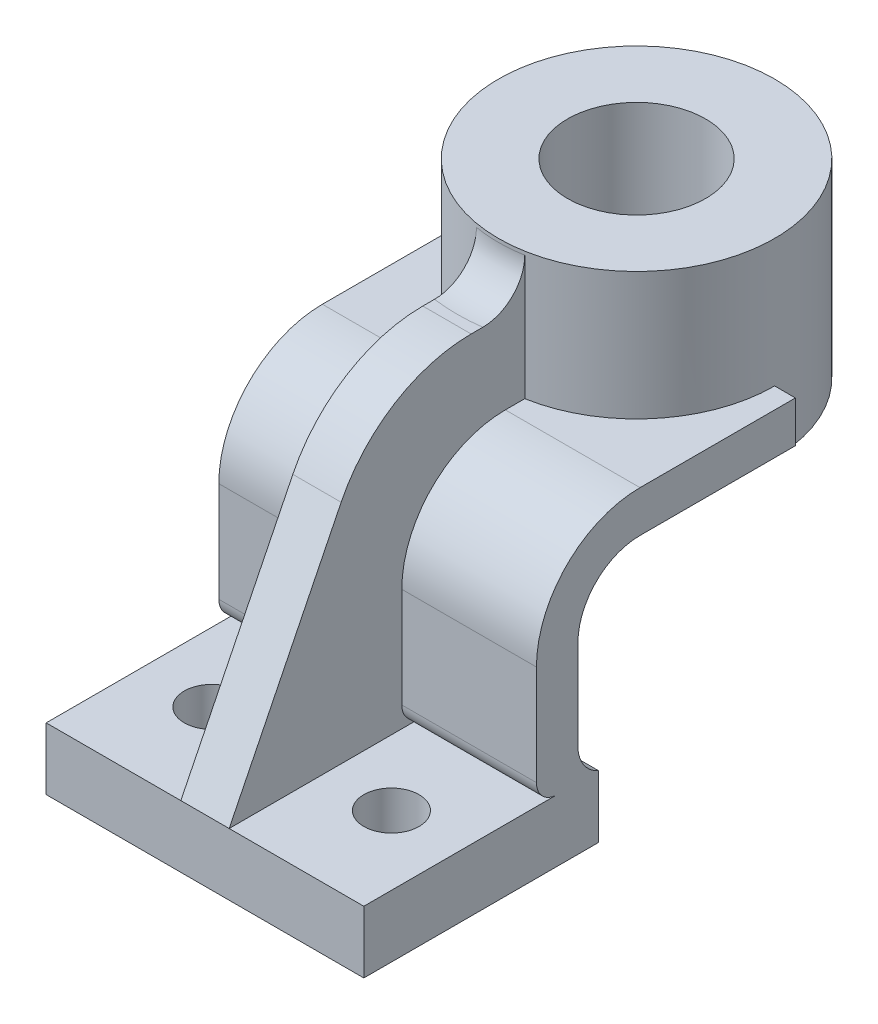
ISO-10303-21;
HEADER;
FILE_DESCRIPTION(('STEP AP214'),'2;1');
FILE_NAME('part.step','',(''),(''),'','','');
FILE_SCHEMA(('AUTOMOTIVE_DESIGN { 1 0 10303 214 1 1 1 1 }'));
ENDSEC;
DATA;
#1=APPLICATION_CONTEXT('core data for automotive mechanical design processes');
#2=APPLICATION_PROTOCOL_DEFINITION('international standard','automotive_design',2000,#1);
#3=PRODUCT_CONTEXT('',#1,'mechanical');
#4=PRODUCT('Part','Part','',(#3));
#5=PRODUCT_RELATED_PRODUCT_CATEGORY('part','',(#4));
#6=PRODUCT_DEFINITION_FORMATION('','',#4);
#7=PRODUCT_DEFINITION_CONTEXT('part definition',#1,'design');
#8=PRODUCT_DEFINITION('design','',#6,#7);
#9=PRODUCT_DEFINITION_SHAPE('','',#8);
#10=(LENGTH_UNIT() NAMED_UNIT(*) SI_UNIT(.MILLI.,.METRE.));
#11=(NAMED_UNIT(*) PLANE_ANGLE_UNIT() SI_UNIT($,.RADIAN.));
#12=(NAMED_UNIT(*) SI_UNIT($,.STERADIAN.) SOLID_ANGLE_UNIT());
#13=UNCERTAINTY_MEASURE_WITH_UNIT(LENGTH_MEASURE(1.E-05),#10,'distance_accuracy_value','');
#14=(GEOMETRIC_REPRESENTATION_CONTEXT(3) GLOBAL_UNCERTAINTY_ASSIGNED_CONTEXT((#13)) GLOBAL_UNIT_ASSIGNED_CONTEXT((#10,
#11,#12)) REPRESENTATION_CONTEXT('',''));
#15=CARTESIAN_POINT('',(0.,0.,0.));
#16=DIRECTION('',(0.,0.,1.));
#17=DIRECTION('',(1.,0.,0.));
#18=AXIS2_PLACEMENT_3D('',#15,#16,#17);
#19=CARTESIAN_POINT('',(0.,18.,0.));
#20=DIRECTION('',(0.,1.,0.));
#21=DIRECTION('',(0.,0.,1.));
#22=AXIS2_PLACEMENT_3D('',#19,#20,#21);
#23=PLANE('',#22);
#24=CARTESIAN_POINT('',(-26.,18.,6.00000000000001));
#25=DIRECTION('',(0.,1.,0.));
#26=DIRECTION('',(0.,0.,1.));
#27=AXIS2_PLACEMENT_3D('',#24,#25,#26);
#28=CIRCLE('',#27,8.);
#29=CARTESIAN_POINT('',(-26.,18.,14.));
#30=VERTEX_POINT('',#29);
#31=EDGE_CURVE('E283',#30,#30,#28,.T.);
#32=ORIENTED_EDGE('',*,*,#31,.F.);
#33=EDGE_LOOP('',(#32));
#34=FACE_BOUND('',#33,.T.);
#35=DIRECTION('',(1.,0.,0.));
#36=VECTOR('',#35,1.);
#37=CARTESIAN_POINT('',(46.,18.,34.));
#38=LINE('',#37,#36);
#39=CARTESIAN_POINT('',(-46.,18.,34.));
#40=VERTEX_POINT('',#39);
#41=CARTESIAN_POINT('',(-7.,18.,34.));
#42=VERTEX_POINT('',#41);
#43=EDGE_CURVE('E245',#40,#42,#38,.T.);
#44=ORIENTED_EDGE('',*,*,#43,.T.);
#45=DIRECTION('',(0.,0.,-1.));
#46=VECTOR('',#45,1.);
#47=CARTESIAN_POINT('',(-7.,18.,0.));
#48=LINE('',#47,#46);
#49=CARTESIAN_POINT('',(-7.,18.,-22.0000000000001));
#50=VERTEX_POINT('',#49);
#51=EDGE_CURVE('E230',#42,#50,#48,.T.);
#52=ORIENTED_EDGE('',*,*,#51,.T.);
#53=DIRECTION('',(1.,0.,0.));
#54=VECTOR('',#53,1.);
#55=CARTESIAN_POINT('',(-46.,18.,-22.0000000000001));
#56=LINE('',#55,#54);
#57=CARTESIAN_POINT('',(-46.,18.,-22.0000000000001));
#58=VERTEX_POINT('',#57);
#59=EDGE_CURVE('E279',#58,#50,#56,.T.);
#60=ORIENTED_EDGE('',*,*,#59,.F.);
#61=DIRECTION('',(0.,0.,1.));
#62=VECTOR('',#61,1.);
#63=CARTESIAN_POINT('',(-46.,18.,34.));
#64=LINE('',#63,#62);
#65=EDGE_CURVE('E252',#58,#40,#64,.T.);
#66=ORIENTED_EDGE('',*,*,#65,.T.);
#67=EDGE_LOOP('',(#44,#52,#60,#66));
#68=FACE_BOUND('',#67,.T.);
#69=ADVANCED_FACE('F41',(#34,#68),#23,.T.);
#70=CARTESIAN_POINT('',(-46.,24.,-22.));
#71=DIRECTION('',(1.,0.,0.));
#72=DIRECTION('',(0.,0.,-1.));
#73=AXIS2_PLACEMENT_3D('',#70,#71,#72);
#74=CYLINDRICAL_SURFACE('',#73,6.);
#75=ORIENTED_EDGE('',*,*,#59,.T.);
#76=CARTESIAN_POINT('',(-7.,24.,-22.));
#77=DIRECTION('',(1.,0.,0.));
#78=DIRECTION('',(0.,0.,-1.));
#79=AXIS2_PLACEMENT_3D('',#76,#77,#78);
#80=CIRCLE('',#79,6.);
#81=CARTESIAN_POINT('',(-7.,24.,-16.));
#82=VERTEX_POINT('',#81);
#83=EDGE_CURVE('E233',#50,#82,#80,.F.);
#84=ORIENTED_EDGE('',*,*,#83,.T.);
#85=DIRECTION('',(1.,0.,0.));
#86=VECTOR('',#85,1.);
#87=CARTESIAN_POINT('',(-46.,24.,-16.));
#88=LINE('',#87,#86);
#89=CARTESIAN_POINT('',(-46.,24.,-16.));
#90=VERTEX_POINT('',#89);
#91=EDGE_CURVE('E320',#90,#82,#88,.T.);
#92=ORIENTED_EDGE('',*,*,#91,.F.);
#93=CARTESIAN_POINT('',(-46.,24.,-22.));
#94=DIRECTION('',(1.,0.,0.));
#95=DIRECTION('',(0.,0.,-1.));
#96=AXIS2_PLACEMENT_3D('',#93,#94,#95);
#97=CIRCLE('',#96,6.);
#98=EDGE_CURVE('E296',#90,#58,#97,.T.);
#99=ORIENTED_EDGE('',*,*,#98,.T.);
#100=EDGE_LOOP('',(#75,#84,#92,#99));
#101=FACE_BOUND('',#100,.T.);
#102=ADVANCED_FACE('F519',(#101),#74,.T.);
#103=CARTESIAN_POINT('',(-46.,24.,-16.));
#104=DIRECTION('',(0.,0.,1.));
#105=DIRECTION('',(1.,0.,0.));
#106=AXIS2_PLACEMENT_3D('',#103,#104,#105);
#107=PLANE('',#106);
#108=ORIENTED_EDGE('',*,*,#91,.T.);
#109=DIRECTION('',(0.,1.,0.));
#110=VECTOR('',#109,1.);
#111=CARTESIAN_POINT('',(-7.,24.,-16.));
#112=LINE('',#111,#110);
#113=CARTESIAN_POINT('',(-7.,52.9999999999999,-16.));
#114=VERTEX_POINT('',#113);
#115=EDGE_CURVE('E441',#82,#114,#112,.T.);
#116=ORIENTED_EDGE('',*,*,#115,.T.);
#117=DIRECTION('',(1.,0.,0.));
#118=VECTOR('',#117,1.);
#119=CARTESIAN_POINT('',(-46.,52.9999999999999,-16.));
#120=LINE('',#119,#118);
#121=CARTESIAN_POINT('',(-46.,52.9999999999999,-16.));
#122=VERTEX_POINT('',#121);
#123=EDGE_CURVE('E315',#122,#114,#120,.T.);
#124=ORIENTED_EDGE('',*,*,#123,.F.);
#125=DIRECTION('',(0.,-1.,0.));
#126=VECTOR('',#125,1.);
#127=CARTESIAN_POINT('',(-46.,24.,-16.));
#128=LINE('',#127,#126);
#129=EDGE_CURVE('E363',#122,#90,#128,.T.);
#130=ORIENTED_EDGE('',*,*,#129,.T.);
#131=EDGE_LOOP('',(#108,#116,#124,#130));
#132=FACE_BOUND('',#131,.T.);
#133=ADVANCED_FACE('F524',(#132),#107,.T.);
#134=CARTESIAN_POINT('',(-46.,53.,-46.));
#135=DIRECTION('',(1.,0.,0.));
#136=DIRECTION('',(0.,0.,-1.));
#137=AXIS2_PLACEMENT_3D('',#134,#135,#136);
#138=CYLINDRICAL_SURFACE('',#137,30.);
#139=ORIENTED_EDGE('',*,*,#123,.T.);
#140=CARTESIAN_POINT('',(-7.,53.,-46.));
#141=DIRECTION('',(1.,0.,0.));
#142=DIRECTION('',(0.,0.,-1.));
#143=AXIS2_PLACEMENT_3D('',#140,#141,#142);
#144=CIRCLE('',#143,30.);
#145=CARTESIAN_POINT('',(-7.,83.,-46.0000000000002));
#146=VERTEX_POINT('',#145);
#147=EDGE_CURVE('E437',#114,#146,#144,.F.);
#148=ORIENTED_EDGE('',*,*,#147,.T.);
#149=DIRECTION('',(1.,0.,0.));
#150=VECTOR('',#149,1.);
#151=CARTESIAN_POINT('',(-46.,83.,-46.0000000000002));
#152=LINE('',#151,#150);
#153=CARTESIAN_POINT('',(-46.,83.,-46.0000000000002));
#154=VERTEX_POINT('',#153);
#155=EDGE_CURVE('E310',#154,#146,#152,.T.);
#156=ORIENTED_EDGE('',*,*,#155,.F.);
#157=CARTESIAN_POINT('',(-46.,53.,-46.));
#158=DIRECTION('',(1.,0.,0.));
#159=DIRECTION('',(0.,0.,1.));
#160=AXIS2_PLACEMENT_3D('',#157,#158,#159);
#161=CIRCLE('',#160,30.);
#162=EDGE_CURVE('E367',#154,#122,#161,.T.);
#163=ORIENTED_EDGE('',*,*,#162,.T.);
#164=EDGE_LOOP('',(#139,#148,#156,#163));
#165=FACE_BOUND('',#164,.T.);
#166=ADVANCED_FACE('F529',(#165),#138,.T.);
#167=CARTESIAN_POINT('',(-46.,83.,-46.0000000000002));
#168=DIRECTION('',(0.,1.,0.));
#169=DIRECTION('',(0.,0.,1.));
#170=AXIS2_PLACEMENT_3D('',#167,#168,#169);
#171=PLANE('',#170);
#172=ORIENTED_EDGE('',*,*,#155,.T.);
#173=DIRECTION('',(0.,0.,-1.));
#174=VECTOR('',#173,1.);
#175=CARTESIAN_POINT('',(-7.,83.,-46.0000000000002));
#176=LINE('',#175,#174);
#177=CARTESIAN_POINT('',(-7.,83.,-51.6172626649696));
#178=VERTEX_POINT('',#177);
#179=EDGE_CURVE('E433',#146,#178,#176,.T.);
#180=ORIENTED_EDGE('',*,*,#179,.T.);
#181=CARTESIAN_POINT('',(0.,83.,-91.));
#182=DIRECTION('',(0.,1.,0.));
#183=DIRECTION('',(0.,0.,1.));
#184=AXIS2_PLACEMENT_3D('',#181,#182,#183);
#185=CIRCLE('',#184,40.);
#186=CARTESIAN_POINT('',(-40.,83.,-91.));
#187=VERTEX_POINT('',#186);
#188=EDGE_CURVE('E360',#187,#178,#185,.T.);
#189=ORIENTED_EDGE('',*,*,#188,.F.);
#190=DIRECTION('',(1.,0.,0.));
#191=VECTOR('',#190,1.);
#192=CARTESIAN_POINT('',(-46.,83.,-91.));
#193=LINE('',#192,#191);
#194=CARTESIAN_POINT('',(-46.,83.,-91.));
#195=VERTEX_POINT('',#194);
#196=EDGE_CURVE('E305',#195,#187,#193,.T.);
#197=ORIENTED_EDGE('',*,*,#196,.F.);
#198=DIRECTION('',(0.,0.,1.));
#199=VECTOR('',#198,1.);
#200=CARTESIAN_POINT('',(-46.,83.,-46.0000000000002));
#201=LINE('',#200,#199);
#202=EDGE_CURVE('E371',#195,#154,#201,.T.);
#203=ORIENTED_EDGE('',*,*,#202,.T.);
#204=EDGE_LOOP('',(#172,#180,#189,#197,#203));
#205=FACE_BOUND('',#204,.T.);
#206=ADVANCED_FACE('F534',(#205),#171,.T.);
#207=CARTESIAN_POINT('',(-46.,83.,-91.));
#208=DIRECTION('',(0.,0.,-1.));
#209=DIRECTION('',(-1.,0.,0.));
#210=AXIS2_PLACEMENT_3D('',#207,#208,#209);
#211=PLANE('',#210);
#212=DIRECTION('',(0.,1.,0.));
#213=VECTOR('',#212,1.);
#214=CARTESIAN_POINT('',(-40.,65.,-91.));
#215=LINE('',#214,#213);
#216=CARTESIAN_POINT('',(-40.,71.,-91.));
#217=VERTEX_POINT('',#216);
#218=EDGE_CURVE('E392',#217,#187,#215,.T.);
#219=ORIENTED_EDGE('',*,*,#218,.F.);
#220=DIRECTION('',(1.,0.,0.));
#221=VECTOR('',#220,1.);
#222=CARTESIAN_POINT('',(-46.,71.,-91.));
#223=LINE('',#222,#221);
#224=CARTESIAN_POINT('',(-46.,71.,-91.));
#225=VERTEX_POINT('',#224);
#226=EDGE_CURVE('E300',#225,#217,#223,.T.);
#227=ORIENTED_EDGE('',*,*,#226,.F.);
#228=DIRECTION('',(0.,1.,0.));
#229=VECTOR('',#228,1.);
#230=CARTESIAN_POINT('',(-46.,83.,-91.));
#231=LINE('',#230,#229);
#232=EDGE_CURVE('E375',#225,#195,#231,.T.);
#233=ORIENTED_EDGE('',*,*,#232,.T.);
#234=ORIENTED_EDGE('',*,*,#196,.T.);
#235=EDGE_LOOP('',(#219,#227,#233,#234));
#236=FACE_BOUND('',#235,.T.);
#237=ADVANCED_FACE('F539',(#236),#211,.T.);
#238=DIRECTION('',(0.,0.,-1.));
#239=VECTOR('',#238,1.);
#240=CARTESIAN_POINT('',(7.,18.,0.));
#241=LINE('',#240,#239);
#242=CARTESIAN_POINT('',(7.,18.,34.));
#243=VERTEX_POINT('',#242);
#244=CARTESIAN_POINT('',(7.,18.,-22.0000000000001));
#245=VERTEX_POINT('',#244);
#246=EDGE_CURVE('E428',#243,#245,#241,.T.);
#247=ORIENTED_EDGE('',*,*,#246,.F.);
#248=CARTESIAN_POINT('',(46.,18.,34.));
#249=VERTEX_POINT('',#248);
#250=EDGE_CURVE('E248',#243,#249,#38,.T.);
#251=ORIENTED_EDGE('',*,*,#250,.T.);
#252=DIRECTION('',(0.,0.,-1.));
#253=VECTOR('',#252,1.);
#254=CARTESIAN_POINT('',(46.,18.,34.));
#255=LINE('',#254,#253);
#256=CARTESIAN_POINT('',(46.,18.,-22.0000000000001));
#257=VERTEX_POINT('',#256);
#258=EDGE_CURVE('E254',#249,#257,#255,.T.);
#259=ORIENTED_EDGE('',*,*,#258,.T.);
#260=EDGE_CURVE('E324',#245,#257,#56,.T.);
#261=ORIENTED_EDGE('',*,*,#260,.F.);
#262=EDGE_LOOP('',(#247,#251,#259,#261));
#263=FACE_BOUND('',#262,.T.);
#264=CARTESIAN_POINT('',(26.,18.,6.00000000000001));
#265=DIRECTION('',(0.,1.,0.));
#266=DIRECTION('',(0.,0.,1.));
#267=AXIS2_PLACEMENT_3D('',#264,#265,#266);
#268=CIRCLE('',#267,7.99999999999999);
#269=CARTESIAN_POINT('',(26.,18.,14.));
#270=VERTEX_POINT('',#269);
#271=EDGE_CURVE('E274',#270,#270,#268,.T.);
#272=ORIENTED_EDGE('',*,*,#271,.F.);
#273=EDGE_LOOP('',(#272));
#274=FACE_BOUND('',#273,.T.);
#275=ADVANCED_FACE('F559',(#263,#274),#23,.T.);
#276=CARTESIAN_POINT('',(-46.,18.,34.));
#277=DIRECTION('',(1.,0.,0.));
#278=DIRECTION('',(0.,0.,-1.));
#279=AXIS2_PLACEMENT_3D('',#276,#277,#278);
#280=PLANE('',#279);
#281=DIRECTION('',(0.,0.,1.));
#282=VECTOR('',#281,1.);
#283=CARTESIAN_POINT('',(-46.,0.,34.));
#284=LINE('',#283,#282);
#285=CARTESIAN_POINT('',(-46.,0.,-34.));
#286=VERTEX_POINT('',#285);
#287=CARTESIAN_POINT('',(-46.,0.,34.));
#288=VERTEX_POINT('',#287);
#289=EDGE_CURVE('E291',#286,#288,#284,.T.);
#290=ORIENTED_EDGE('',*,*,#289,.T.);
#291=DIRECTION('',(0.,-1.,0.));
#292=VECTOR('',#291,1.);
#293=CARTESIAN_POINT('',(-46.,18.,34.));
#294=LINE('',#293,#292);
#295=EDGE_CURVE('E601',#40,#288,#294,.T.);
#296=ORIENTED_EDGE('',*,*,#295,.F.);
#297=ORIENTED_EDGE('',*,*,#65,.F.);
#298=ORIENTED_EDGE('',*,*,#98,.F.);
#299=ORIENTED_EDGE('',*,*,#129,.F.);
#300=ORIENTED_EDGE('',*,*,#162,.F.);
#301=ORIENTED_EDGE('',*,*,#202,.F.);
#302=ORIENTED_EDGE('',*,*,#232,.F.);
#303=DIRECTION('',(0.,0.,-1.));
#304=VECTOR('',#303,1.);
#305=CARTESIAN_POINT('',(-46.,71.,-46.0000000000001));
#306=LINE('',#305,#304);
#307=CARTESIAN_POINT('',(-46.,71.,-46.0000000000001));
#308=VERTEX_POINT('',#307);
#309=EDGE_CURVE('E379',#308,#225,#306,.T.);
#310=ORIENTED_EDGE('',*,*,#309,.F.);
#311=CARTESIAN_POINT('',(-46.,53.,-46.));
#312=DIRECTION('',(-1.,0.,0.));
#313=DIRECTION('',(0.,0.,1.));
#314=AXIS2_PLACEMENT_3D('',#311,#312,#313);
#315=CIRCLE('',#314,18.);
#316=CARTESIAN_POINT('',(-46.,52.9999999999999,-28.));
#317=VERTEX_POINT('',#316);
#318=EDGE_CURVE('E383',#317,#308,#315,.T.);
#319=ORIENTED_EDGE('',*,*,#318,.F.);
#320=DIRECTION('',(0.,1.,0.));
#321=VECTOR('',#320,1.);
#322=CARTESIAN_POINT('',(-46.,18.,-28.));
#323=LINE('',#322,#321);
#324=CARTESIAN_POINT('',(-46.,27.1651513899117,-28.));
#325=VERTEX_POINT('',#324);
#326=EDGE_CURVE('E331',#325,#317,#323,.T.);
#327=ORIENTED_EDGE('',*,*,#326,.F.);
#328=CARTESIAN_POINT('',(-46.,27.1651513899117,-38.));
#329=DIRECTION('',(1.,0.,0.));
#330=DIRECTION('',(0.,0.,-1.));
#331=AXIS2_PLACEMENT_3D('',#328,#329,#330);
#332=CIRCLE('',#331,10.);
#333=CARTESIAN_POINT('',(-46.,18.,-34.));
#334=VERTEX_POINT('',#333);
#335=EDGE_CURVE('E620',#325,#334,#332,.T.);
#336=ORIENTED_EDGE('',*,*,#335,.T.);
#337=DIRECTION('',(0.,-1.,0.));
#338=VECTOR('',#337,1.);
#339=CARTESIAN_POINT('',(-46.,18.,-34.));
#340=LINE('',#339,#338);
#341=EDGE_CURVE('E690',#334,#286,#340,.T.);
#342=ORIENTED_EDGE('',*,*,#341,.T.);
#343=EDGE_LOOP('',(#290,#296,#297,#298,#299,#300,#301,#302,#310,#319,#327,#336,#342));
#344=FACE_BOUND('',#343,.T.);
#345=ADVANCED_FACE('F562',(#344),#280,.F.);
#346=CARTESIAN_POINT('',(46.,18.,34.));
#347=DIRECTION('',(0.,0.,-1.));
#348=DIRECTION('',(-1.,0.,0.));
#349=AXIS2_PLACEMENT_3D('',#346,#347,#348);
#350=PLANE('',#349);
#351=ORIENTED_EDGE('',*,*,#250,.F.);
#352=EDGE_CURVE('E219',#42,#243,#38,.T.);
#353=ORIENTED_EDGE('',*,*,#352,.F.);
#354=ORIENTED_EDGE('',*,*,#43,.F.);
#355=ORIENTED_EDGE('',*,*,#295,.T.);
#356=DIRECTION('',(1.,0.,0.));
#357=VECTOR('',#356,1.);
#358=CARTESIAN_POINT('',(46.,0.,34.));
#359=LINE('',#358,#357);
#360=CARTESIAN_POINT('',(46.,0.,34.));
#361=VERTEX_POINT('',#360);
#362=EDGE_CURVE('E720',#288,#361,#359,.T.);
#363=ORIENTED_EDGE('',*,*,#362,.T.);
#364=DIRECTION('',(0.,-1.,0.));
#365=VECTOR('',#364,1.);
#366=CARTESIAN_POINT('',(46.,18.,34.));
#367=LINE('',#366,#365);
#368=EDGE_CURVE('E605',#249,#361,#367,.T.);
#369=ORIENTED_EDGE('',*,*,#368,.F.);
#370=EDGE_LOOP('',(#351,#353,#354,#355,#363,#369));
#371=FACE_BOUND('',#370,.T.);
#372=ADVANCED_FACE('F243',(#371),#350,.F.);
#373=CARTESIAN_POINT('',(46.,18.,34.));
#374=DIRECTION('',(-1.,0.,0.));
#375=DIRECTION('',(0.,0.,1.));
#376=AXIS2_PLACEMENT_3D('',#373,#374,#375);
#377=PLANE('',#376);
#378=DIRECTION('',(0.,0.,-1.));
#379=VECTOR('',#378,1.);
#380=CARTESIAN_POINT('',(46.,0.,34.));
#381=LINE('',#380,#379);
#382=CARTESIAN_POINT('',(46.,0.,-34.));
#383=VERTEX_POINT('',#382);
#384=EDGE_CURVE('E271',#361,#383,#381,.T.);
#385=ORIENTED_EDGE('',*,*,#384,.T.);
#386=DIRECTION('',(0.,-1.,0.));
#387=VECTOR('',#386,1.);
#388=CARTESIAN_POINT('',(46.,18.,-34.));
#389=LINE('',#388,#387);
#390=CARTESIAN_POINT('',(46.,18.,-34.));
#391=VERTEX_POINT('',#390);
#392=EDGE_CURVE('E614',#391,#383,#389,.T.);
#393=ORIENTED_EDGE('',*,*,#392,.F.);
#394=CARTESIAN_POINT('',(46.,27.1651513899117,-38.));
#395=DIRECTION('',(-1.,0.,0.));
#396=DIRECTION('',(0.,0.,1.));
#397=AXIS2_PLACEMENT_3D('',#394,#395,#396);
#398=CIRCLE('',#397,10.);
#399=CARTESIAN_POINT('',(46.,27.1651513899117,-28.));
#400=VERTEX_POINT('',#399);
#401=EDGE_CURVE('E610',#391,#400,#398,.T.);
#402=ORIENTED_EDGE('',*,*,#401,.T.);
#403=DIRECTION('',(0.,1.,0.));
#404=VECTOR('',#403,1.);
#405=CARTESIAN_POINT('',(46.,18.,-28.));
#406=LINE('',#405,#404);
#407=CARTESIAN_POINT('',(46.,52.9999999999999,-28.));
#408=VERTEX_POINT('',#407);
#409=EDGE_CURVE('E356',#400,#408,#406,.T.);
#410=ORIENTED_EDGE('',*,*,#409,.T.);
#411=CARTESIAN_POINT('',(46.,53.,-46.));
#412=DIRECTION('',(-1.,0.,0.));
#413=DIRECTION('',(0.,0.,1.));
#414=AXIS2_PLACEMENT_3D('',#411,#412,#413);
#415=CIRCLE('',#414,18.);
#416=CARTESIAN_POINT('',(46.,71.,-46.0000000000001));
#417=VERTEX_POINT('',#416);
#418=EDGE_CURVE('E352',#408,#417,#415,.T.);
#419=ORIENTED_EDGE('',*,*,#418,.T.);
#420=DIRECTION('',(0.,0.,-1.));
#421=VECTOR('',#420,1.);
#422=CARTESIAN_POINT('',(46.,71.,-46.0000000000001));
#423=LINE('',#422,#421);
#424=CARTESIAN_POINT('',(46.,71.,-91.));
#425=VERTEX_POINT('',#424);
#426=EDGE_CURVE('E348',#417,#425,#423,.T.);
#427=ORIENTED_EDGE('',*,*,#426,.T.);
#428=DIRECTION('',(0.,1.,0.));
#429=VECTOR('',#428,1.);
#430=CARTESIAN_POINT('',(46.,83.,-91.));
#431=LINE('',#430,#429);
#432=CARTESIAN_POINT('',(46.,83.,-91.));
#433=VERTEX_POINT('',#432);
#434=EDGE_CURVE('E344',#425,#433,#431,.T.);
#435=ORIENTED_EDGE('',*,*,#434,.T.);
#436=DIRECTION('',(0.,0.,1.));
#437=VECTOR('',#436,1.);
#438=CARTESIAN_POINT('',(46.,83.,-46.0000000000002));
#439=LINE('',#438,#437);
#440=CARTESIAN_POINT('',(46.,83.,-46.0000000000002));
#441=VERTEX_POINT('',#440);
#442=EDGE_CURVE('E340',#433,#441,#439,.T.);
#443=ORIENTED_EDGE('',*,*,#442,.T.);
#444=CARTESIAN_POINT('',(46.,53.,-46.));
#445=DIRECTION('',(1.,0.,0.));
#446=DIRECTION('',(0.,0.,1.));
#447=AXIS2_PLACEMENT_3D('',#444,#445,#446);
#448=CIRCLE('',#447,30.);
#449=CARTESIAN_POINT('',(46.,52.9999999999999,-16.));
#450=VERTEX_POINT('',#449);
#451=EDGE_CURVE('E336',#441,#450,#448,.T.);
#452=ORIENTED_EDGE('',*,*,#451,.T.);
#453=DIRECTION('',(0.,-1.,0.));
#454=VECTOR('',#453,1.);
#455=CARTESIAN_POINT('',(46.,24.,-16.));
#456=LINE('',#455,#454);
#457=CARTESIAN_POINT('',(46.,24.,-16.));
#458=VERTEX_POINT('',#457);
#459=EDGE_CURVE('E332',#450,#458,#456,.T.);
#460=ORIENTED_EDGE('',*,*,#459,.T.);
#461=CARTESIAN_POINT('',(46.,24.,-22.));
#462=DIRECTION('',(1.,0.,0.));
#463=DIRECTION('',(0.,0.,-1.));
#464=AXIS2_PLACEMENT_3D('',#461,#462,#463);
#465=CIRCLE('',#464,6.);
#466=EDGE_CURVE('E327',#458,#257,#465,.T.);
#467=ORIENTED_EDGE('',*,*,#466,.T.);
#468=ORIENTED_EDGE('',*,*,#258,.F.);
#469=ORIENTED_EDGE('',*,*,#368,.T.);
#470=EDGE_LOOP('',(#385,#393,#402,#410,#419,#427,#435,#443,#452,#460,#467,#468,#469));
#471=FACE_BOUND('',#470,.T.);
#472=ADVANCED_FACE('F569',(#471),#377,.F.);
#473=CARTESIAN_POINT('',(46.,18.,-34.));
#474=DIRECTION('',(0.,0.,1.));
#475=DIRECTION('',(1.,0.,0.));
#476=AXIS2_PLACEMENT_3D('',#473,#474,#475);
#477=PLANE('',#476);
#478=DIRECTION('',(-1.,0.,0.));
#479=VECTOR('',#478,1.);
#480=CARTESIAN_POINT('',(46.,0.,-34.));
#481=LINE('',#480,#479);
#482=EDGE_CURVE('E267',#383,#286,#481,.T.);
#483=ORIENTED_EDGE('',*,*,#482,.T.);
#484=ORIENTED_EDGE('',*,*,#341,.F.);
#485=DIRECTION('',(-1.,0.,0.));
#486=VECTOR('',#485,1.);
#487=CARTESIAN_POINT('',(46.,18.,-34.));
#488=LINE('',#487,#486);
#489=EDGE_CURVE('E260',#391,#334,#488,.T.);
#490=ORIENTED_EDGE('',*,*,#489,.F.);
#491=ORIENTED_EDGE('',*,*,#392,.T.);
#492=EDGE_LOOP('',(#483,#484,#490,#491));
#493=FACE_BOUND('',#492,.T.);
#494=ADVANCED_FACE('F565',(#493),#477,.F.);
#495=CARTESIAN_POINT('',(0.,0.,0.));
#496=DIRECTION('',(0.,1.,0.));
#497=DIRECTION('',(0.,0.,1.));
#498=AXIS2_PLACEMENT_3D('',#495,#496,#497);
#499=PLANE('',#498);
#500=CARTESIAN_POINT('',(26.,0.,6.00000000000001));
#501=DIRECTION('',(0.,1.,0.));
#502=DIRECTION('',(0.,0.,1.));
#503=AXIS2_PLACEMENT_3D('',#500,#501,#502);
#504=CIRCLE('',#503,7.99999999999999);
#505=CARTESIAN_POINT('',(26.,0.,14.));
#506=VERTEX_POINT('',#505);
#507=EDGE_CURVE('E278',#506,#506,#504,.T.);
#508=ORIENTED_EDGE('',*,*,#507,.T.);
#509=EDGE_LOOP('',(#508));
#510=FACE_BOUND('',#509,.T.);
#511=ORIENTED_EDGE('',*,*,#384,.F.);
#512=ORIENTED_EDGE('',*,*,#362,.F.);
#513=ORIENTED_EDGE('',*,*,#289,.F.);
#514=ORIENTED_EDGE('',*,*,#482,.F.);
#515=EDGE_LOOP('',(#511,#512,#513,#514));
#516=FACE_BOUND('',#515,.T.);
#517=CARTESIAN_POINT('',(-26.,0.,6.00000000000001));
#518=DIRECTION('',(0.,1.,0.));
#519=DIRECTION('',(0.,0.,1.));
#520=AXIS2_PLACEMENT_3D('',#517,#518,#519);
#521=CIRCLE('',#520,8.);
#522=CARTESIAN_POINT('',(-26.,0.,14.));
#523=VERTEX_POINT('',#522);
#524=EDGE_CURVE('E287',#523,#523,#521,.T.);
#525=ORIENTED_EDGE('',*,*,#524,.T.);
#526=EDGE_LOOP('',(#525));
#527=FACE_BOUND('',#526,.T.);
#528=ADVANCED_FACE('F557',(#510,#516,#527),#499,.F.);
#529=CARTESIAN_POINT('',(26.,0.,6.00000000000001));
#530=DIRECTION('',(0.,1.,0.));
#531=DIRECTION('',(0.,0.,1.));
#532=AXIS2_PLACEMENT_3D('',#529,#530,#531);
#533=CYLINDRICAL_SURFACE('',#532,7.99999999999999);
#534=ORIENTED_EDGE('',*,*,#507,.F.);
#535=EDGE_LOOP('',(#534));
#536=FACE_BOUND('',#535,.T.);
#537=ORIENTED_EDGE('',*,*,#271,.T.);
#538=EDGE_LOOP('',(#537));
#539=FACE_BOUND('',#538,.T.);
#540=ADVANCED_FACE('F553',(#536,#539),#533,.F.);
#541=CARTESIAN_POINT('',(-26.,0.,6.00000000000001));
#542=DIRECTION('',(0.,1.,0.));
#543=DIRECTION('',(0.,0.,1.));
#544=AXIS2_PLACEMENT_3D('',#541,#542,#543);
#545=CYLINDRICAL_SURFACE('',#544,8.);
#546=ORIENTED_EDGE('',*,*,#524,.F.);
#547=EDGE_LOOP('',(#546));
#548=FACE_BOUND('',#547,.T.);
#549=ORIENTED_EDGE('',*,*,#31,.T.);
#550=EDGE_LOOP('',(#549));
#551=FACE_BOUND('',#550,.T.);
#552=ADVANCED_FACE('F517',(#548,#551),#545,.F.);
#553=CARTESIAN_POINT('',(7.,24.,-22.));
#554=DIRECTION('',(1.,0.,0.));
#555=DIRECTION('',(0.,0.,-1.));
#556=AXIS2_PLACEMENT_3D('',#553,#554,#555);
#557=CIRCLE('',#556,6.);
#558=CARTESIAN_POINT('',(7.,24.,-16.));
#559=VERTEX_POINT('',#558);
#560=EDGE_CURVE('E425',#245,#559,#557,.F.);
#561=ORIENTED_EDGE('',*,*,#560,.F.);
#562=ORIENTED_EDGE('',*,*,#260,.T.);
#563=ORIENTED_EDGE('',*,*,#466,.F.);
#564=EDGE_CURVE('E319',#559,#458,#88,.T.);
#565=ORIENTED_EDGE('',*,*,#564,.F.);
#566=EDGE_LOOP('',(#561,#562,#563,#565));
#567=FACE_BOUND('',#566,.T.);
#568=ADVANCED_FACE('F513',(#567),#74,.T.);
#569=DIRECTION('',(0.,1.,0.));
#570=VECTOR('',#569,1.);
#571=CARTESIAN_POINT('',(7.,24.,-16.));
#572=LINE('',#571,#570);
#573=CARTESIAN_POINT('',(7.,52.9999999999999,-16.));
#574=VERTEX_POINT('',#573);
#575=EDGE_CURVE('E422',#559,#574,#572,.T.);
#576=ORIENTED_EDGE('',*,*,#575,.F.);
#577=ORIENTED_EDGE('',*,*,#564,.T.);
#578=ORIENTED_EDGE('',*,*,#459,.F.);
#579=EDGE_CURVE('E314',#574,#450,#120,.T.);
#580=ORIENTED_EDGE('',*,*,#579,.F.);
#581=EDGE_LOOP('',(#576,#577,#578,#580));
#582=FACE_BOUND('',#581,.T.);
#583=ADVANCED_FACE('F516',(#582),#107,.T.);
#584=CARTESIAN_POINT('',(7.,53.,-46.));
#585=DIRECTION('',(1.,0.,0.));
#586=DIRECTION('',(0.,0.,-1.));
#587=AXIS2_PLACEMENT_3D('',#584,#585,#586);
#588=CIRCLE('',#587,30.);
#589=CARTESIAN_POINT('',(7.,83.,-46.0000000000002));
#590=VERTEX_POINT('',#589);
#591=EDGE_CURVE('E419',#574,#590,#588,.F.);
#592=ORIENTED_EDGE('',*,*,#591,.F.);
#593=ORIENTED_EDGE('',*,*,#579,.T.);
#594=ORIENTED_EDGE('',*,*,#451,.F.);
#595=EDGE_CURVE('E309',#590,#441,#152,.T.);
#596=ORIENTED_EDGE('',*,*,#595,.F.);
#597=EDGE_LOOP('',(#592,#593,#594,#596));
#598=FACE_BOUND('',#597,.T.);
#599=ADVANCED_FACE('F522',(#598),#138,.T.);
#600=DIRECTION('',(0.,0.,-1.));
#601=VECTOR('',#600,1.);
#602=CARTESIAN_POINT('',(7.,83.,-46.0000000000002));
#603=LINE('',#602,#601);
#604=CARTESIAN_POINT('',(7.,83.,-51.6172626649696));
#605=VERTEX_POINT('',#604);
#606=EDGE_CURVE('E416',#590,#605,#603,.T.);
#607=ORIENTED_EDGE('',*,*,#606,.F.);
#608=ORIENTED_EDGE('',*,*,#595,.T.);
#609=ORIENTED_EDGE('',*,*,#442,.F.);
#610=CARTESIAN_POINT('',(40.,83.,-91.));
#611=VERTEX_POINT('',#610);
#612=EDGE_CURVE('E304',#611,#433,#193,.T.);
#613=ORIENTED_EDGE('',*,*,#612,.F.);
#614=EDGE_CURVE('E391',#605,#611,#185,.T.);
#615=ORIENTED_EDGE('',*,*,#614,.F.);
#616=EDGE_LOOP('',(#607,#608,#609,#613,#615));
#617=FACE_BOUND('',#616,.T.);
#618=ADVANCED_FACE('F527',(#617),#171,.T.);
#619=DIRECTION('',(0.,1.,0.));
#620=VECTOR('',#619,1.);
#621=CARTESIAN_POINT('',(40.,65.,-91.));
#622=LINE('',#621,#620);
#623=CARTESIAN_POINT('',(40.,71.,-91.));
#624=VERTEX_POINT('',#623);
#625=EDGE_CURVE('E396',#611,#624,#622,.F.);
#626=ORIENTED_EDGE('',*,*,#625,.F.);
#627=ORIENTED_EDGE('',*,*,#612,.T.);
#628=ORIENTED_EDGE('',*,*,#434,.F.);
#629=EDGE_CURVE('E299',#624,#425,#223,.T.);
#630=ORIENTED_EDGE('',*,*,#629,.F.);
#631=EDGE_LOOP('',(#626,#627,#628,#630));
#632=FACE_BOUND('',#631,.T.);
#633=ADVANCED_FACE('F532',(#632),#211,.T.);
#634=CARTESIAN_POINT('',(-46.,71.,-46.0000000000001));
#635=DIRECTION('',(0.,-1.,0.));
#636=DIRECTION('',(0.,0.,-1.));
#637=AXIS2_PLACEMENT_3D('',#634,#635,#636);
#638=PLANE('',#637);
#639=ORIENTED_EDGE('',*,*,#426,.F.);
#640=DIRECTION('',(1.,0.,0.));
#641=VECTOR('',#640,1.);
#642=CARTESIAN_POINT('',(-46.,71.,-46.0000000000001));
#643=LINE('',#642,#641);
#644=EDGE_CURVE('E295',#308,#417,#643,.T.);
#645=ORIENTED_EDGE('',*,*,#644,.F.);
#646=ORIENTED_EDGE('',*,*,#309,.T.);
#647=ORIENTED_EDGE('',*,*,#226,.T.);
#648=CARTESIAN_POINT('',(0.,71.,-91.));
#649=DIRECTION('',(0.,-1.,0.));
#650=DIRECTION('',(0.,0.,-1.));
#651=AXIS2_PLACEMENT_3D('',#648,#649,#650);
#652=CIRCLE('',#651,40.);
#653=EDGE_CURVE('E624',#624,#217,#652,.T.);
#654=ORIENTED_EDGE('',*,*,#653,.F.);
#655=ORIENTED_EDGE('',*,*,#629,.T.);
#656=EDGE_LOOP('',(#639,#645,#646,#647,#654,#655));
#657=FACE_BOUND('',#656,.T.);
#658=ADVANCED_FACE('F537',(#657),#638,.T.);
#659=CARTESIAN_POINT('',(-46.,53.,-46.));
#660=DIRECTION('',(1.,0.,0.));
#661=DIRECTION('',(0.,0.,-1.));
#662=AXIS2_PLACEMENT_3D('',#659,#660,#661);
#663=CYLINDRICAL_SURFACE('',#662,18.);
#664=ORIENTED_EDGE('',*,*,#418,.F.);
#665=DIRECTION('',(1.,0.,0.));
#666=VECTOR('',#665,1.);
#667=CARTESIAN_POINT('',(-46.,52.9999999999999,-28.));
#668=LINE('',#667,#666);
#669=EDGE_CURVE('E292',#317,#408,#668,.T.);
#670=ORIENTED_EDGE('',*,*,#669,.F.);
#671=ORIENTED_EDGE('',*,*,#318,.T.);
#672=ORIENTED_EDGE('',*,*,#644,.T.);
#673=EDGE_LOOP('',(#664,#670,#671,#672));
#674=FACE_BOUND('',#673,.T.);
#675=ADVANCED_FACE('F542',(#674),#663,.F.);
#676=CARTESIAN_POINT('',(-46.,18.,-28.));
#677=DIRECTION('',(0.,0.,-1.));
#678=DIRECTION('',(-1.,0.,0.));
#679=AXIS2_PLACEMENT_3D('',#676,#677,#678);
#680=PLANE('',#679);
#681=DIRECTION('',(-1.,0.,0.));
#682=VECTOR('',#681,1.);
#683=CARTESIAN_POINT('',(-46.,27.1651513899117,-28.));
#684=LINE('',#683,#682);
#685=EDGE_CURVE('E604',#400,#325,#684,.T.);
#686=ORIENTED_EDGE('',*,*,#685,.T.);
#687=ORIENTED_EDGE('',*,*,#326,.T.);
#688=ORIENTED_EDGE('',*,*,#669,.T.);
#689=ORIENTED_EDGE('',*,*,#409,.F.);
#690=EDGE_LOOP('',(#686,#687,#688,#689));
#691=FACE_BOUND('',#690,.T.);
#692=ADVANCED_FACE('F546',(#691),#680,.T.);
#693=CARTESIAN_POINT('',(0.,27.1651513899117,-38.));
#694=DIRECTION('',(1.,0.,0.));
#695=DIRECTION('',(0.,0.,-1.));
#696=AXIS2_PLACEMENT_3D('',#693,#694,#695);
#697=CYLINDRICAL_SURFACE('',#696,10.);
#698=ORIENTED_EDGE('',*,*,#489,.T.);
#699=ORIENTED_EDGE('',*,*,#335,.F.);
#700=ORIENTED_EDGE('',*,*,#685,.F.);
#701=ORIENTED_EDGE('',*,*,#401,.F.);
#702=EDGE_LOOP('',(#698,#699,#700,#701));
#703=FACE_BOUND('',#702,.T.);
#704=ADVANCED_FACE('F511',(#703),#697,.F.);
#705=CARTESIAN_POINT('',(0.,65.,-91.));
#706=DIRECTION('',(0.,1.,0.));
#707=DIRECTION('',(0.,0.,1.));
#708=AXIS2_PLACEMENT_3D('',#705,#706,#707);
#709=CYLINDRICAL_SURFACE('',#708,40.);
#710=CARTESIAN_POINT('',(0.,65.,-91.));
#711=DIRECTION('',(0.,1.,0.));
#712=DIRECTION('',(0.,0.,1.));
#713=AXIS2_PLACEMENT_3D('',#710,#711,#712);
#714=CIRCLE('',#713,40.);
#715=CARTESIAN_POINT('',(0.,65.,-51.));
#716=VERTEX_POINT('',#715);
#717=EDGE_CURVE('E400',#716,#716,#714,.T.);
#718=ORIENTED_EDGE('',*,*,#717,.T.);
#719=EDGE_LOOP('',(#718));
#720=FACE_BOUND('',#719,.T.);
#721=DIRECTION('',(0.,1.,0.));
#722=VECTOR('',#721,1.);
#723=CARTESIAN_POINT('',(-7.,65.,-51.6172626649696));
#724=LINE('',#723,#722);
#725=CARTESIAN_POINT('',(-7.,119.,-51.6172626649696));
#726=VERTEX_POINT('',#725);
#727=EDGE_CURVE('E63',#178,#726,#724,.T.);
#728=ORIENTED_EDGE('',*,*,#727,.T.);
#729=CARTESIAN_POINT('',(0.,119.,-91.));
#730=DIRECTION('',(0.,1.,0.));
#731=DIRECTION('',(0.,0.,1.));
#732=AXIS2_PLACEMENT_3D('',#729,#730,#731);
#733=CIRCLE('',#732,40.);
#734=CARTESIAN_POINT('',(7.,119.,-51.6172626649696));
#735=VERTEX_POINT('',#734);
#736=EDGE_CURVE('E478',#726,#735,#733,.T.);
#737=ORIENTED_EDGE('',*,*,#736,.T.);
#738=DIRECTION('',(0.,1.,0.));
#739=VECTOR('',#738,1.);
#740=CARTESIAN_POINT('',(7.,65.,-51.6172626649696));
#741=LINE('',#740,#739);
#742=EDGE_CURVE('E70',#605,#735,#741,.T.);
#743=ORIENTED_EDGE('',*,*,#742,.F.);
#744=ORIENTED_EDGE('',*,*,#614,.T.);
#745=ORIENTED_EDGE('',*,*,#625,.T.);
#746=ORIENTED_EDGE('',*,*,#653,.T.);
#747=ORIENTED_EDGE('',*,*,#218,.T.);
#748=ORIENTED_EDGE('',*,*,#188,.T.);
#749=EDGE_LOOP('',(#728,#737,#743,#744,#745,#746,#747,#748));
#750=FACE_BOUND('',#749,.T.);
#751=CARTESIAN_POINT('',(0.,120.,-91.));
#752=DIRECTION('',(0.,1.,0.));
#753=DIRECTION('',(0.,0.,1.));
#754=AXIS2_PLACEMENT_3D('',#751,#752,#753);
#755=CIRCLE('',#754,40.);
#756=CARTESIAN_POINT('',(0.,120.,-51.));
#757=VERTEX_POINT('',#756);
#758=EDGE_CURVE('E404',#757,#757,#755,.T.);
#759=ORIENTED_EDGE('',*,*,#758,.F.);
#760=EDGE_LOOP('',(#759));
#761=FACE_BOUND('',#760,.T.);
#762=ADVANCED_FACE('F507',(#720,#750,#761),#709,.T.);
#763=CARTESIAN_POINT('',(0.,65.,-91.));
#764=DIRECTION('',(0.,1.,0.));
#765=DIRECTION('',(0.,0.,1.));
#766=AXIS2_PLACEMENT_3D('',#763,#764,#765);
#767=PLANE('',#766);
#768=CARTESIAN_POINT('',(0.,65.,-91.));
#769=DIRECTION('',(0.,1.,0.));
#770=DIRECTION('',(0.,0.,1.));
#771=AXIS2_PLACEMENT_3D('',#768,#769,#770);
#772=CIRCLE('',#771,20.);
#773=CARTESIAN_POINT('',(0.,65.,-71.));
#774=VERTEX_POINT('',#773);
#775=EDGE_CURVE('E408',#774,#774,#772,.T.);
#776=ORIENTED_EDGE('',*,*,#775,.T.);
#777=EDGE_LOOP('',(#776));
#778=FACE_BOUND('',#777,.T.);
#779=ORIENTED_EDGE('',*,*,#717,.F.);
#780=EDGE_LOOP('',(#779));
#781=FACE_BOUND('',#780,.T.);
#782=ADVANCED_FACE('F503',(#778,#781),#767,.F.);
#783=CARTESIAN_POINT('',(0.,120.,-91.));
#784=DIRECTION('',(0.,1.,0.));
#785=DIRECTION('',(0.,0.,1.));
#786=AXIS2_PLACEMENT_3D('',#783,#784,#785);
#787=PLANE('',#786);
#788=CARTESIAN_POINT('',(0.,120.,-91.));
#789=DIRECTION('',(0.,1.,0.));
#790=DIRECTION('',(0.,0.,1.));
#791=AXIS2_PLACEMENT_3D('',#788,#789,#790);
#792=CIRCLE('',#791,20.);
#793=CARTESIAN_POINT('',(0.,120.,-71.));
#794=VERTEX_POINT('',#793);
#795=EDGE_CURVE('E412',#794,#794,#792,.T.);
#796=ORIENTED_EDGE('',*,*,#795,.F.);
#797=EDGE_LOOP('',(#796));
#798=FACE_BOUND('',#797,.T.);
#799=ORIENTED_EDGE('',*,*,#758,.T.);
#800=EDGE_LOOP('',(#799));
#801=FACE_BOUND('',#800,.T.);
#802=ADVANCED_FACE('F499',(#798,#801),#787,.T.);
#803=CARTESIAN_POINT('',(0.,0.,-91.));
#804=DIRECTION('',(0.,1.,0.));
#805=DIRECTION('',(0.,0.,1.));
#806=AXIS2_PLACEMENT_3D('',#803,#804,#805);
#807=CYLINDRICAL_SURFACE('',#806,20.);
#808=ORIENTED_EDGE('',*,*,#775,.F.);
#809=EDGE_LOOP('',(#808));
#810=FACE_BOUND('',#809,.T.);
#811=ORIENTED_EDGE('',*,*,#795,.T.);
#812=EDGE_LOOP('',(#811));
#813=FACE_BOUND('',#812,.T.);
#814=ADVANCED_FACE('F493',(#810,#813),#807,.F.);
#815=CARTESIAN_POINT('',(0.,107.,-10.));
#816=DIRECTION('',(0.,0.443180148025079,0.896432572141636));
#817=DIRECTION('',(0.,-0.896432572141636,0.443180148025079));
#818=AXIS2_PLACEMENT_3D('',#815,#816,#817);
#819=PLANE('',#818);
#820=DIRECTION('',(0.,-0.896432572141636,0.443180148025079));
#821=VECTOR('',#820,1.);
#822=CARTESIAN_POINT('',(7.,107.,-10.));
#823=LINE('',#822,#821);
#824=CARTESIAN_POINT('',(7.,83.6135662170533,1.56183243201858));
#825=VERTEX_POINT('',#824);
#826=EDGE_CURVE('E450',#825,#243,#823,.T.);
#827=ORIENTED_EDGE('',*,*,#826,.F.);
#828=DIRECTION('',(1.,0.,0.));
#829=VECTOR('',#828,1.);
#830=CARTESIAN_POINT('',(0.,83.6135662170533,1.56183243201858));
#831=LINE('',#830,#829);
#832=CARTESIAN_POINT('',(-7.,83.6135662170533,1.56183243201858));
#833=VERTEX_POINT('',#832);
#834=EDGE_CURVE('E222',#825,#833,#831,.F.);
#835=ORIENTED_EDGE('',*,*,#834,.T.);
#836=DIRECTION('',(0.,-0.896432572141636,0.443180148025079));
#837=VECTOR('',#836,1.);
#838=CARTESIAN_POINT('',(-7.,107.,-10.));
#839=LINE('',#838,#837);
#840=EDGE_CURVE('E214',#833,#42,#839,.T.);
#841=ORIENTED_EDGE('',*,*,#840,.T.);
#842=ORIENTED_EDGE('',*,*,#352,.T.);
#843=EDGE_LOOP('',(#827,#835,#841,#842));
#844=FACE_BOUND('',#843,.T.);
#845=ADVANCED_FACE('F217',(#844),#819,.T.);
#846=CARTESIAN_POINT('',(0.,107.,-52.));
#847=DIRECTION('',(0.,1.,0.));
#848=DIRECTION('',(0.,0.,1.));
#849=AXIS2_PLACEMENT_3D('',#846,#847,#848);
#850=PLANE('',#849);
#851=DIRECTION('',(0.,0.,-1.));
#852=VECTOR('',#851,1.);
#853=CARTESIAN_POINT('',(7.,107.,-48.5));
#854=LINE('',#853,#852);
#855=CARTESIAN_POINT('',(7.,107.,-39.473307888047));
#856=VERTEX_POINT('',#855);
#857=CARTESIAN_POINT('',(7.,107.,-36.0883355979301));
#858=VERTEX_POINT('',#857);
#859=EDGE_CURVE('E238',#856,#858,#854,.F.);
#860=ORIENTED_EDGE('',*,*,#859,.F.);
#861=CARTESIAN_POINT('',(0.,107.,-91.));
#862=DIRECTION('',(0.,1.,0.));
#863=DIRECTION('',(0.,0.,1.));
#864=AXIS2_PLACEMENT_3D('',#861,#862,#863);
#865=CIRCLE('',#864,52.);
#866=CARTESIAN_POINT('',(-7.,107.,-39.473307888047));
#867=VERTEX_POINT('',#866);
#868=EDGE_CURVE('E470',#856,#867,#865,.F.);
#869=ORIENTED_EDGE('',*,*,#868,.T.);
#870=DIRECTION('',(0.,0.,-1.));
#871=VECTOR('',#870,1.);
#872=CARTESIAN_POINT('',(-7.,107.,-48.5));
#873=LINE('',#872,#871);
#874=CARTESIAN_POINT('',(-7.,107.,-36.0883355979301));
#875=VERTEX_POINT('',#874);
#876=EDGE_CURVE('E227',#867,#875,#873,.F.);
#877=ORIENTED_EDGE('',*,*,#876,.T.);
#878=DIRECTION('',(1.,0.,0.));
#879=VECTOR('',#878,1.);
#880=CARTESIAN_POINT('',(0.,107.,-36.0883355979301));
#881=LINE('',#880,#879);
#882=EDGE_CURVE('E472',#875,#858,#881,.T.);
#883=ORIENTED_EDGE('',*,*,#882,.T.);
#884=EDGE_LOOP('',(#860,#869,#877,#883));
#885=FACE_BOUND('',#884,.T.);
#886=ADVANCED_FACE('F492',(#885),#850,.T.);
#887=CARTESIAN_POINT('',(7.,60.,-48.5));
#888=DIRECTION('',(1.,0.,0.));
#889=DIRECTION('',(0.,0.,-1.));
#890=AXIS2_PLACEMENT_3D('',#887,#888,#889);
#891=PLANE('',#890);
#892=ORIENTED_EDGE('',*,*,#742,.T.);
#893=CARTESIAN_POINT('',(7.,119.,-51.6172626649696));
#894=CARTESIAN_POINT('',(7.,118.665948418998,-51.6173032512437));
#895=CARTESIAN_POINT('',(7.,118.331904556968,-51.6030969601544));
#896=CARTESIAN_POINT('',(7.,117.666242936142,-51.5464854474783));
#897=CARTESIAN_POINT('',(7.,117.334624968825,-51.5040826790437));
#898=CARTESIAN_POINT('',(7.,116.676578708458,-51.3914434388541));
#899=CARTESIAN_POINT('',(7.,116.350144442271,-51.3212418523725));
#900=CARTESIAN_POINT('',(7.,115.704358443017,-51.1535739430391));
#901=CARTESIAN_POINT('',(7.,115.385006679121,-51.0561077388921));
#902=CARTESIAN_POINT('',(7.,114.755543594671,-50.8346400201154));
#903=CARTESIAN_POINT('',(7.,114.445434855087,-50.7106311714998));
#904=CARTESIAN_POINT('',(7.,113.83670483093,-50.4370516817915));
#905=CARTESIAN_POINT('',(7.,113.53808366207,-50.2874807832964));
#906=CARTESIAN_POINT('',(7.,112.954395441143,-49.9639201403556));
#907=CARTESIAN_POINT('',(7.,112.669327861355,-49.7899313476849));
#908=CARTESIAN_POINT('',(7.,112.114668274205,-49.4188288608041));
#909=CARTESIAN_POINT('',(7.,111.84507629216,-49.221715128764));
#910=CARTESIAN_POINT('',(7.,111.321134142642,-48.8041803588119));
#911=CARTESIAN_POINT('',(7.,111.066919449065,-48.5835893230941));
#912=CARTESIAN_POINT('',(7.,110.577751603243,-48.1219957372938));
#913=CARTESIAN_POINT('',(7.,110.342798619826,-47.8809930083414));
#914=CARTESIAN_POINT('',(7.,109.89367216968,-47.3802535645956));
#915=CARTESIAN_POINT('',(7.,109.679503244967,-47.1205127764295));
#916=CARTESIAN_POINT('',(7.,109.273422370229,-46.5841858768845));
#917=CARTESIAN_POINT('',(7.,109.081510300801,-46.3075998558882));
#918=CARTESIAN_POINT('',(7.,108.718730919795,-45.7356091985885));
#919=CARTESIAN_POINT('',(7.,108.548188582901,-45.4399983857547));
#920=CARTESIAN_POINT('',(7.,108.232425540526,-44.8355485658647));
#921=CARTESIAN_POINT('',(7.,108.087205303868,-44.5267093140234));
#922=CARTESIAN_POINT('',(7.,107.823122417671,-43.8980839476921));
#923=CARTESIAN_POINT('',(7.,107.704249770729,-43.5783020386668));
#924=CARTESIAN_POINT('',(7.,107.493631761069,-42.9300587699843));
#925=CARTESIAN_POINT('',(7.,107.401880554374,-42.6015992967612));
#926=CARTESIAN_POINT('',(7.,107.216445542497,-41.8117293930383));
#927=CARTESIAN_POINT('',(7.,107.135306458387,-41.3472792125398));
#928=CARTESIAN_POINT('',(7.,107.054150623956,-40.6465400935378));
#929=CARTESIAN_POINT('',(7.,107.033857507242,-40.4124032955818));
#930=CARTESIAN_POINT('',(7.,107.006782380564,-39.9433019174412));
#931=CARTESIAN_POINT('',(7.,107.000003122498,-39.7083371784154));
#932=CARTESIAN_POINT('',(7.,107.,-39.473307888047));
#933=B_SPLINE_CURVE_WITH_KNOTS('',3,(#893,#894,#895,#896,#897,#898,#899,#900,#901,#902,#903,
#904,#905,#906,#907,#908,#909,#910,#911,#912,#913,#914,#915,#916,#917,#918,#919,#920,#921,#922,
#923,#924,#925,#926,#927,#928,#929,#930,#931,#932),.UNSPECIFIED.,.F.,.F.,(4,2,2,2,2,2,2,2,2,2,2,
2,2,2,2,2,2,2,2,4),(0.,1.00184144249826,2.00359573410707,3.00409686873454,4.00459364744404,
5.00536723065771,6.00615089195945,7.00689555495597,8.00764185509058,9.01620353441802,
10.024774052794,11.0335644837845,12.0423495026214,13.0649794758121,14.0876283804019,
15.1098885814075,16.1319283506393,17.5427987298998,18.2475168292171,18.9523784192929),.UNSPECIFIED.);
#934=EDGE_CURVE('E11',#735,#856,#933,.T.);
#935=ORIENTED_EDGE('',*,*,#934,.T.);
#936=ORIENTED_EDGE('',*,*,#859,.T.);
#937=CARTESIAN_POINT('',(7.,65.,-36.0883355979301));
#938=DIRECTION('',(1.,0.,0.));
#939=DIRECTION('',(0.,0.,-1.));
#940=AXIS2_PLACEMENT_3D('',#937,#938,#939);
#941=CIRCLE('',#940,42.);
#942=EDGE_CURVE('E459',#858,#825,#941,.T.);
#943=ORIENTED_EDGE('',*,*,#942,.T.);
#944=ORIENTED_EDGE('',*,*,#826,.T.);
#945=ORIENTED_EDGE('',*,*,#246,.T.);
#946=ORIENTED_EDGE('',*,*,#560,.T.);
#947=ORIENTED_EDGE('',*,*,#575,.T.);
#948=ORIENTED_EDGE('',*,*,#591,.T.);
#949=ORIENTED_EDGE('',*,*,#606,.T.);
#950=EDGE_LOOP('',(#892,#935,#936,#943,#944,#945,#946,#947,#948,#949));
#951=FACE_BOUND('',#950,.T.);
#952=ADVANCED_FACE('F456',(#951),#891,.T.);
#953=CARTESIAN_POINT('',(-7.,60.,-48.5));
#954=DIRECTION('',(1.,0.,0.));
#955=DIRECTION('',(0.,0.,-1.));
#956=AXIS2_PLACEMENT_3D('',#953,#954,#955);
#957=PLANE('',#956);
#958=ORIENTED_EDGE('',*,*,#840,.F.);
#959=CARTESIAN_POINT('',(-7.,65.,-36.0883355979301));
#960=DIRECTION('',(1.,0.,0.));
#961=DIRECTION('',(0.,0.,-1.));
#962=AXIS2_PLACEMENT_3D('',#959,#960,#961);
#963=CIRCLE('',#962,42.);
#964=EDGE_CURVE('E464',#833,#875,#963,.F.);
#965=ORIENTED_EDGE('',*,*,#964,.T.);
#966=ORIENTED_EDGE('',*,*,#876,.F.);
#967=CARTESIAN_POINT('',(-7.,107.,-39.473307888047));
#968=CARTESIAN_POINT('',(-7.,106.999965013806,-39.8173305196641));
#969=CARTESIAN_POINT('',(-7.,107.014524388435,-40.161345934305));
#970=CARTESIAN_POINT('',(-7.,107.072546282651,-40.8469139458257));
#971=CARTESIAN_POINT('',(-7.,107.116007316995,-41.1884666683506));
#972=CARTESIAN_POINT('',(-7.,107.231512245742,-41.8664927041082));
#973=CARTESIAN_POINT('',(-7.,107.303538924632,-42.2029689502047));
#974=CARTESIAN_POINT('',(-7.,107.475648867575,-42.8686640746859));
#975=CARTESIAN_POINT('',(-7.,107.575731864771,-43.1978830220663));
#976=CARTESIAN_POINT('',(-7.,107.803311167568,-43.846881955105));
#977=CARTESIAN_POINT('',(-7.,107.930820471428,-44.1666573831487));
#978=CARTESIAN_POINT('',(-7.,108.212339617729,-44.7943220020174));
#979=CARTESIAN_POINT('',(-7.,108.366349375703,-45.1022112307251));
#980=CARTESIAN_POINT('',(-7.,108.699778745265,-45.7038379634401));
#981=CARTESIAN_POINT('',(-7.,108.879193781934,-45.9975780026636));
#982=CARTESIAN_POINT('',(-7.,109.262219224868,-46.5688346024141));
#983=CARTESIAN_POINT('',(-7.,109.465829456137,-46.846351280259));
#984=CARTESIAN_POINT('',(-7.,109.895429698724,-47.3826131481666));
#985=CARTESIAN_POINT('',(-7.,110.121376044172,-47.6413933152456));
#986=CARTESIAN_POINT('',(-7.,110.594415122198,-48.138851979918));
#987=CARTESIAN_POINT('',(-7.,110.841507978972,-48.3775303594346));
#988=CARTESIAN_POINT('',(-7.,111.355166147039,-48.8330291453918));
#989=CARTESIAN_POINT('',(-7.,111.621735089709,-49.0498454575523));
#990=CARTESIAN_POINT('',(-7.,112.172421794674,-49.4599023714229));
#991=CARTESIAN_POINT('',(-7.,112.456539100178,-49.6531435864109));
#992=CARTESIAN_POINT('',(-7.,113.037411873926,-50.0127569371902));
#993=CARTESIAN_POINT('',(-7.,113.33401440826,-50.1793760991433));
#994=CARTESIAN_POINT('',(-7.,113.940338157545,-50.4867288317683));
#995=CARTESIAN_POINT('',(-7.,114.250059220848,-50.6274627015717));
#996=CARTESIAN_POINT('',(-7.,114.880210938423,-50.8818472946975));
#997=CARTESIAN_POINT('',(-7.,115.200634535441,-50.9955154782663));
#998=CARTESIAN_POINT('',(-7.,115.849916845697,-51.1949383368485));
#999=CARTESIAN_POINT('',(-7.,116.178773171077,-51.2807008216599));
#1000=CARTESIAN_POINT('',(-7.,116.919683942272,-51.4402246297616));
#1001=CARTESIAN_POINT('',(-7.,117.333367212462,-51.5066059482629));
#1002=CARTESIAN_POINT('',(-7.,117.956934327007,-51.5729891205319));
#1003=CARTESIAN_POINT('',(-7.,118.165190353449,-51.5895853589736));
#1004=CARTESIAN_POINT('',(-7.,118.582282377439,-51.6117214378957));
#1005=CARTESIAN_POINT('',(-7.,118.791118355777,-51.6172616403215));
#1006=CARTESIAN_POINT('',(-7.,119.,-51.6172626649696));
#1007=B_SPLINE_CURVE_WITH_KNOTS('',3,(#967,#968,#969,#970,#971,#972,#973,#974,#975,#976,#977,
#978,#979,#980,#981,#982,#983,#984,#985,#986,#987,#988,#989,#990,#991,#992,#993,#994,#995,#996,
#997,#998,#999,#1000,#1001,#1002,#1003,#1004,#1005,#1006),.UNSPECIFIED.,.F.,.F.,(4,2,2,2,2,2,2,
2,2,2,2,2,2,2,2,2,2,2,2,4),(0.,1.03174980052517,2.06344658395997,3.09452254243865,
4.12558869418866,5.15714458415435,6.1886971861721,7.22006426437436,8.25142388341001,
9.28080569194065,10.3101935465803,11.3397738260555,12.3693273165148,13.3886899319617,
14.4080407668708,15.4267322195984,16.4451383316487,17.6994143789669,18.3259153166722,
18.952395744061),.UNSPECIFIED.);
#1008=EDGE_CURVE('E56',#867,#726,#1007,.T.);
#1009=ORIENTED_EDGE('',*,*,#1008,.T.);
#1010=ORIENTED_EDGE('',*,*,#727,.F.);
#1011=ORIENTED_EDGE('',*,*,#179,.F.);
#1012=ORIENTED_EDGE('',*,*,#147,.F.);
#1013=ORIENTED_EDGE('',*,*,#115,.F.);
#1014=ORIENTED_EDGE('',*,*,#83,.F.);
#1015=ORIENTED_EDGE('',*,*,#51,.F.);
#1016=EDGE_LOOP('',(#958,#965,#966,#1009,#1010,#1011,#1012,#1013,#1014,#1015));
#1017=FACE_BOUND('',#1016,.T.);
#1018=ADVANCED_FACE('F231',(#1017),#957,.F.);
#1019=CARTESIAN_POINT('',(0.,65.,-36.0883355979301));
#1020=DIRECTION('',(1.,0.,0.));
#1021=DIRECTION('',(0.,0.,-1.));
#1022=AXIS2_PLACEMENT_3D('',#1019,#1020,#1021);
#1023=CYLINDRICAL_SURFACE('',#1022,42.);
#1024=ORIENTED_EDGE('',*,*,#964,.F.);
#1025=ORIENTED_EDGE('',*,*,#834,.F.);
#1026=ORIENTED_EDGE('',*,*,#942,.F.);
#1027=ORIENTED_EDGE('',*,*,#882,.F.);
#1028=EDGE_LOOP('',(#1024,#1025,#1026,#1027));
#1029=FACE_BOUND('',#1028,.T.);
#1030=ADVANCED_FACE('F461',(#1029),#1023,.T.);
#1031=CARTESIAN_POINT('',(0.,119.,-91.));
#1032=DIRECTION('',(0.,1.,0.));
#1033=DIRECTION('',(0.,0.,1.));
#1034=AXIS2_PLACEMENT_3D('',#1031,#1032,#1033);
#1035=TOROIDAL_SURFACE('',#1034,52.,12.);
#1036=ORIENTED_EDGE('',*,*,#934,.F.);
#1037=ORIENTED_EDGE('',*,*,#736,.F.);
#1038=ORIENTED_EDGE('',*,*,#1008,.F.);
#1039=ORIENTED_EDGE('',*,*,#868,.F.);
#1040=EDGE_LOOP('',(#1036,#1037,#1038,#1039));
#1041=FACE_BOUND('',#1040,.T.);
#1042=ADVANCED_FACE('F43',(#1041),#1035,.F.);
#1043=CLOSED_SHELL('',(#69,#102,#133,#166,#206,#237,#275,#345,#372,#472,#494,#528,#540,#552,
#568,#583,#599,#618,#633,#658,#675,#692,#704,#762,#782,#802,#814,#845,#886,#952,#1018,#1030,#1042));
#1044=MANIFOLD_SOLID_BREP('B2',#1043);
#1045=ADVANCED_BREP_SHAPE_REPRESENTATION('',(#18,#1044),#14);
#1046=SHAPE_DEFINITION_REPRESENTATION(#9,#1045);
ENDSEC;
END-ISO-10303-21;
